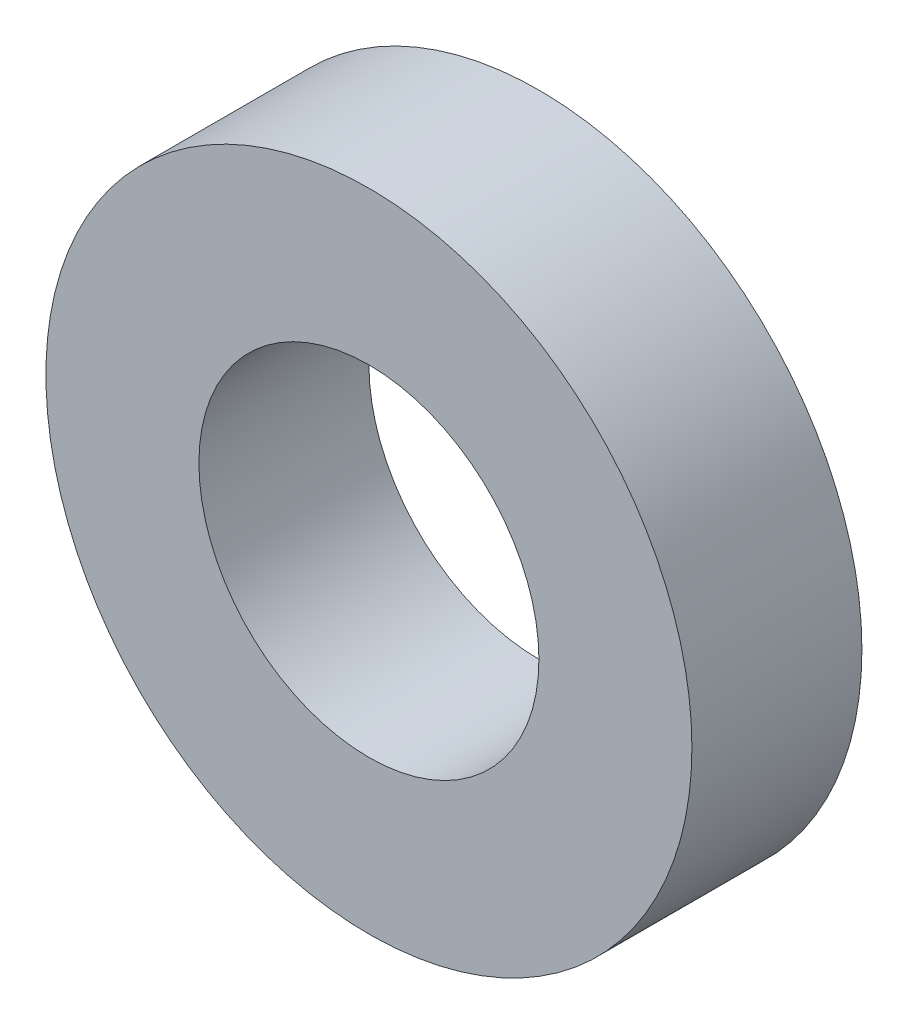
ISO-10303-21;
HEADER;
FILE_DESCRIPTION(('STEP AP214'),'2;1');
FILE_NAME('part.step','',(''),(''),'','','');
FILE_SCHEMA(('AUTOMOTIVE_DESIGN { 1 0 10303 214 1 1 1 1 }'));
ENDSEC;
DATA;
#1=APPLICATION_CONTEXT('core data for automotive mechanical design processes');
#2=APPLICATION_PROTOCOL_DEFINITION('international standard','automotive_design',2000,#1);
#3=PRODUCT_CONTEXT('',#1,'mechanical');
#4=PRODUCT('Part','Part','',(#3));
#5=PRODUCT_RELATED_PRODUCT_CATEGORY('part','',(#4));
#6=PRODUCT_DEFINITION_FORMATION('','',#4);
#7=PRODUCT_DEFINITION_CONTEXT('part definition',#1,'design');
#8=PRODUCT_DEFINITION('design','',#6,#7);
#9=PRODUCT_DEFINITION_SHAPE('','',#8);
#10=(LENGTH_UNIT() NAMED_UNIT(*) SI_UNIT(.MILLI.,.METRE.));
#11=(NAMED_UNIT(*) PLANE_ANGLE_UNIT() SI_UNIT($,.RADIAN.));
#12=(NAMED_UNIT(*) SI_UNIT($,.STERADIAN.) SOLID_ANGLE_UNIT());
#13=UNCERTAINTY_MEASURE_WITH_UNIT(LENGTH_MEASURE(1.E-05),#10,'distance_accuracy_value','');
#14=(GEOMETRIC_REPRESENTATION_CONTEXT(3) GLOBAL_UNCERTAINTY_ASSIGNED_CONTEXT((#13)) GLOBAL_UNIT_ASSIGNED_CONTEXT((#10,
#11,#12)) REPRESENTATION_CONTEXT('',''));
#15=CARTESIAN_POINT('',(0.,0.,0.));
#16=DIRECTION('',(0.,0.,1.));
#17=DIRECTION('',(1.,0.,0.));
#18=AXIS2_PLACEMENT_3D('',#15,#16,#17);
#19=CARTESIAN_POINT('',(0.,0.,5.));
#20=DIRECTION('',(0.,0.,1.));
#21=DIRECTION('',(1.,0.,0.));
#22=AXIS2_PLACEMENT_3D('',#19,#20,#21);
#23=PLANE('',#22);
#24=CARTESIAN_POINT('',(0.,0.,5.));
#25=DIRECTION('',(0.,0.,1.));
#26=DIRECTION('',(1.,0.,0.));
#27=AXIS2_PLACEMENT_3D('',#24,#25,#26);
#28=CIRCLE('',#27,9.5);
#29=CARTESIAN_POINT('',(9.5,0.,5.));
#30=VERTEX_POINT('',#29);
#31=EDGE_CURVE('E10',#30,#30,#28,.T.);
#32=ORIENTED_EDGE('',*,*,#31,.T.);
#33=EDGE_LOOP('',(#32));
#34=FACE_BOUND('',#33,.T.);
#35=CARTESIAN_POINT('',(0.,0.,5.));
#36=DIRECTION('',(0.,0.,1.));
#37=DIRECTION('',(1.,0.,0.));
#38=AXIS2_PLACEMENT_3D('',#35,#36,#37);
#39=CIRCLE('',#38,5.);
#40=CARTESIAN_POINT('',(5.,0.,5.));
#41=VERTEX_POINT('',#40);
#42=EDGE_CURVE('E43',#41,#41,#39,.T.);
#43=ORIENTED_EDGE('',*,*,#42,.F.);
#44=EDGE_LOOP('',(#43));
#45=FACE_BOUND('',#44,.T.);
#46=ADVANCED_FACE('F32',(#34,#45),#23,.T.);
#47=CARTESIAN_POINT('',(0.,0.,0.));
#48=DIRECTION('',(0.,0.,1.));
#49=DIRECTION('',(1.,0.,0.));
#50=AXIS2_PLACEMENT_3D('',#47,#48,#49);
#51=PLANE('',#50);
#52=CARTESIAN_POINT('',(0.,0.,0.));
#53=DIRECTION('',(0.,0.,1.));
#54=DIRECTION('',(1.,0.,0.));
#55=AXIS2_PLACEMENT_3D('',#52,#53,#54);
#56=CIRCLE('',#55,9.5);
#57=CARTESIAN_POINT('',(9.5,0.,0.));
#58=VERTEX_POINT('',#57);
#59=EDGE_CURVE('E36',#58,#58,#56,.T.);
#60=ORIENTED_EDGE('',*,*,#59,.F.);
#61=EDGE_LOOP('',(#60));
#62=FACE_BOUND('',#61,.T.);
#63=CARTESIAN_POINT('',(0.,0.,0.));
#64=DIRECTION('',(0.,0.,1.));
#65=DIRECTION('',(1.,0.,0.));
#66=AXIS2_PLACEMENT_3D('',#63,#64,#65);
#67=CIRCLE('',#66,5.);
#68=CARTESIAN_POINT('',(5.,0.,0.));
#69=VERTEX_POINT('',#68);
#70=EDGE_CURVE('E45',#69,#69,#67,.T.);
#71=ORIENTED_EDGE('',*,*,#70,.T.);
#72=EDGE_LOOP('',(#71));
#73=FACE_BOUND('',#72,.T.);
#74=ADVANCED_FACE('F55',(#62,#73),#51,.F.);
#75=CARTESIAN_POINT('',(0.,0.,5.));
#76=DIRECTION('',(0.,0.,-1.));
#77=DIRECTION('',(-1.,0.,0.));
#78=AXIS2_PLACEMENT_3D('',#75,#76,#77);
#79=CYLINDRICAL_SURFACE('',#78,9.5);
#80=ORIENTED_EDGE('',*,*,#31,.F.);
#81=EDGE_LOOP('',(#80));
#82=FACE_BOUND('',#81,.T.);
#83=ORIENTED_EDGE('',*,*,#59,.T.);
#84=EDGE_LOOP('',(#83));
#85=FACE_BOUND('',#84,.T.);
#86=ADVANCED_FACE('F34',(#82,#85),#79,.T.);
#87=CARTESIAN_POINT('',(0.,0.,5.));
#88=DIRECTION('',(0.,0.,-1.));
#89=DIRECTION('',(-1.,0.,0.));
#90=AXIS2_PLACEMENT_3D('',#87,#88,#89);
#91=CYLINDRICAL_SURFACE('',#90,5.);
#92=ORIENTED_EDGE('',*,*,#42,.T.);
#93=EDGE_LOOP('',(#92));
#94=FACE_BOUND('',#93,.T.);
#95=ORIENTED_EDGE('',*,*,#70,.F.);
#96=EDGE_LOOP('',(#95));
#97=FACE_BOUND('',#96,.T.);
#98=ADVANCED_FACE('F51',(#94,#97),#91,.F.);
#99=CLOSED_SHELL('',(#46,#74,#86,#98));
#100=MANIFOLD_SOLID_BREP('B2',#99);
#101=ADVANCED_BREP_SHAPE_REPRESENTATION('',(#18,#100),#14);
#102=SHAPE_DEFINITION_REPRESENTATION(#9,#101);
ENDSEC;
END-ISO-10303-21;
